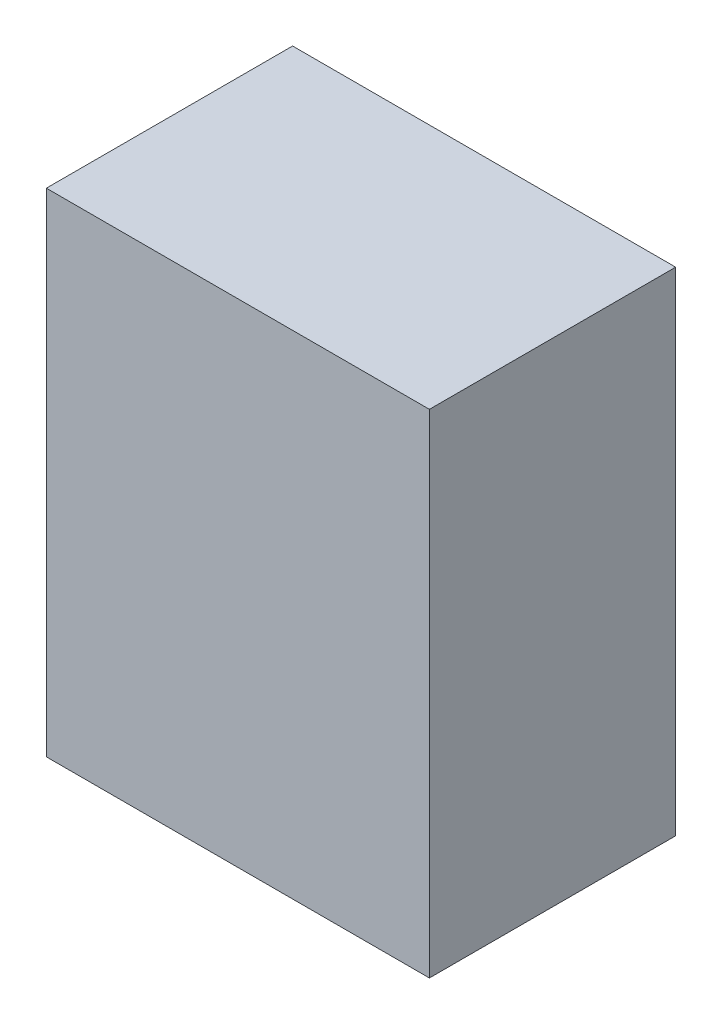
ISO-10303-21;
HEADER;
FILE_DESCRIPTION(('STEP AP214'),'2;1');
FILE_NAME('part.step','',(''),(''),'','','');
FILE_SCHEMA(('AUTOMOTIVE_DESIGN { 1 0 10303 214 1 1 1 1 }'));
ENDSEC;
DATA;
#1=APPLICATION_CONTEXT('core data for automotive mechanical design processes');
#2=APPLICATION_PROTOCOL_DEFINITION('international standard','automotive_design',2000,#1);
#3=PRODUCT_CONTEXT('',#1,'mechanical');
#4=PRODUCT('Part','Part','',(#3));
#5=PRODUCT_RELATED_PRODUCT_CATEGORY('part','',(#4));
#6=PRODUCT_DEFINITION_FORMATION('','',#4);
#7=PRODUCT_DEFINITION_CONTEXT('part definition',#1,'design');
#8=PRODUCT_DEFINITION('design','',#6,#7);
#9=PRODUCT_DEFINITION_SHAPE('','',#8);
#10=(LENGTH_UNIT() NAMED_UNIT(*) SI_UNIT(.MILLI.,.METRE.));
#11=(NAMED_UNIT(*) PLANE_ANGLE_UNIT() SI_UNIT($,.RADIAN.));
#12=(NAMED_UNIT(*) SI_UNIT($,.STERADIAN.) SOLID_ANGLE_UNIT());
#13=UNCERTAINTY_MEASURE_WITH_UNIT(LENGTH_MEASURE(1.E-05),#10,'distance_accuracy_value','');
#14=(GEOMETRIC_REPRESENTATION_CONTEXT(3) GLOBAL_UNCERTAINTY_ASSIGNED_CONTEXT((#13)) GLOBAL_UNIT_ASSIGNED_CONTEXT((#10,
#11,#12)) REPRESENTATION_CONTEXT('',''));
#15=CARTESIAN_POINT('',(0.,0.,0.));
#16=DIRECTION('',(0.,0.,1.));
#17=DIRECTION('',(1.,0.,0.));
#18=AXIS2_PLACEMENT_3D('',#15,#16,#17);
#19=CARTESIAN_POINT('',(1.39999974,-1.79999894,1.79999894));
#20=DIRECTION('',(0.,0.,1.));
#21=DIRECTION('',(1.,0.,0.));
#22=AXIS2_PLACEMENT_3D('',#19,#20,#21);
#23=PLANE('',#22);
#24=DIRECTION('',(0.,1.,0.));
#25=VECTOR('',#24,1.);
#26=CARTESIAN_POINT('',(-1.39999974,-1.79999894,1.79999894));
#27=LINE('',#26,#25);
#28=CARTESIAN_POINT('',(-1.39999974,-1.79999894,1.79999894));
#29=VERTEX_POINT('',#28);
#30=CARTESIAN_POINT('',(-1.39999974,1.80000148,1.79999894));
#31=VERTEX_POINT('',#30);
#32=EDGE_CURVE('E53',#29,#31,#27,.T.);
#33=ORIENTED_EDGE('',*,*,#32,.F.);
#34=DIRECTION('',(1.,0.,0.));
#35=VECTOR('',#34,1.);
#36=CARTESIAN_POINT('',(1.39999974,-1.79999894,1.79999894));
#37=LINE('',#36,#35);
#38=CARTESIAN_POINT('',(1.39999974,-1.79999894,1.79999894));
#39=VERTEX_POINT('',#38);
#40=EDGE_CURVE('E68',#39,#29,#37,.F.);
#41=ORIENTED_EDGE('',*,*,#40,.F.);
#42=DIRECTION('',(0.,1.,0.));
#43=VECTOR('',#42,1.);
#44=CARTESIAN_POINT('',(1.39999974,1.80000148,1.79999894));
#45=LINE('',#44,#43);
#46=CARTESIAN_POINT('',(1.39999974,1.80000148,1.79999894));
#47=VERTEX_POINT('',#46);
#48=EDGE_CURVE('E20',#47,#39,#45,.F.);
#49=ORIENTED_EDGE('',*,*,#48,.F.);
#50=DIRECTION('',(1.,0.,0.));
#51=VECTOR('',#50,1.);
#52=CARTESIAN_POINT('',(-1.39999974,1.80000148,1.79999894));
#53=LINE('',#52,#51);
#54=EDGE_CURVE('E58',#31,#47,#53,.T.);
#55=ORIENTED_EDGE('',*,*,#54,.F.);
#56=EDGE_LOOP('',(#33,#41,#49,#55));
#57=FACE_BOUND('',#56,.T.);
#58=ADVANCED_FACE('F17',(#57),#23,.T.);
#59=CARTESIAN_POINT('',(1.39999974,1.80000148,0.));
#60=DIRECTION('',(1.,0.,0.));
#61=DIRECTION('',(0.,0.,-1.));
#62=AXIS2_PLACEMENT_3D('',#59,#60,#61);
#63=PLANE('',#62);
#64=DIRECTION('',(0.,0.,-1.));
#65=VECTOR('',#64,1.);
#66=CARTESIAN_POINT('',(1.39999974,-1.79999894,0.));
#67=LINE('',#66,#65);
#68=CARTESIAN_POINT('',(1.39999974,-1.79999894,0.));
#69=VERTEX_POINT('',#68);
#70=EDGE_CURVE('E79',#69,#39,#67,.F.);
#71=ORIENTED_EDGE('',*,*,#70,.F.);
#72=DIRECTION('',(0.,1.,0.));
#73=VECTOR('',#72,1.);
#74=CARTESIAN_POINT('',(1.39999974,-1.79999894,0.));
#75=LINE('',#74,#73);
#76=CARTESIAN_POINT('',(1.39999974,1.80000148,0.));
#77=VERTEX_POINT('',#76);
#78=EDGE_CURVE('E74',#69,#77,#75,.T.);
#79=ORIENTED_EDGE('',*,*,#78,.T.);
#80=DIRECTION('',(0.,0.,1.));
#81=VECTOR('',#80,1.);
#82=CARTESIAN_POINT('',(1.39999974,1.80000148,0.));
#83=LINE('',#82,#81);
#84=EDGE_CURVE('E63',#47,#77,#83,.F.);
#85=ORIENTED_EDGE('',*,*,#84,.F.);
#86=ORIENTED_EDGE('',*,*,#48,.T.);
#87=EDGE_LOOP('',(#71,#79,#85,#86));
#88=FACE_BOUND('',#87,.T.);
#89=ADVANCED_FACE('F73',(#88),#63,.T.);
#90=CARTESIAN_POINT('',(-1.39999974,1.80000148,0.));
#91=DIRECTION('',(0.,1.,0.));
#92=DIRECTION('',(0.,0.,1.));
#93=AXIS2_PLACEMENT_3D('',#90,#91,#92);
#94=PLANE('',#93);
#95=ORIENTED_EDGE('',*,*,#84,.T.);
#96=DIRECTION('',(1.,0.,0.));
#97=VECTOR('',#96,1.);
#98=CARTESIAN_POINT('',(1.39999974,1.80000148,0.));
#99=LINE('',#98,#97);
#100=CARTESIAN_POINT('',(-1.39999974,1.80000148,0.));
#101=VERTEX_POINT('',#100);
#102=EDGE_CURVE('E84',#77,#101,#99,.F.);
#103=ORIENTED_EDGE('',*,*,#102,.T.);
#104=DIRECTION('',(0.,0.,1.));
#105=VECTOR('',#104,1.);
#106=CARTESIAN_POINT('',(-1.39999974,1.80000148,0.));
#107=LINE('',#106,#105);
#108=EDGE_CURVE('E65',#31,#101,#107,.F.);
#109=ORIENTED_EDGE('',*,*,#108,.F.);
#110=ORIENTED_EDGE('',*,*,#54,.T.);
#111=EDGE_LOOP('',(#95,#103,#109,#110));
#112=FACE_BOUND('',#111,.T.);
#113=ADVANCED_FACE('F60',(#112),#94,.T.);
#114=CARTESIAN_POINT('',(-1.39999974,-1.79999894,0.));
#115=DIRECTION('',(-1.,0.,0.));
#116=DIRECTION('',(0.,0.,1.));
#117=AXIS2_PLACEMENT_3D('',#114,#115,#116);
#118=PLANE('',#117);
#119=ORIENTED_EDGE('',*,*,#108,.T.);
#120=DIRECTION('',(0.,1.,0.));
#121=VECTOR('',#120,1.);
#122=CARTESIAN_POINT('',(-1.39999974,-1.79999894,0.));
#123=LINE('',#122,#121);
#124=CARTESIAN_POINT('',(-1.39999974,-1.79999894,0.));
#125=VERTEX_POINT('',#124);
#126=EDGE_CURVE('E26',#101,#125,#123,.F.);
#127=ORIENTED_EDGE('',*,*,#126,.T.);
#128=DIRECTION('',(0.,0.,-1.));
#129=VECTOR('',#128,1.);
#130=CARTESIAN_POINT('',(-1.39999974,-1.79999894,0.));
#131=LINE('',#130,#129);
#132=EDGE_CURVE('E34',#29,#125,#131,.T.);
#133=ORIENTED_EDGE('',*,*,#132,.F.);
#134=ORIENTED_EDGE('',*,*,#32,.T.);
#135=EDGE_LOOP('',(#119,#127,#133,#134));
#136=FACE_BOUND('',#135,.T.);
#137=ADVANCED_FACE('F88',(#136),#118,.T.);
#138=CARTESIAN_POINT('',(1.39999974,-1.79999894,0.));
#139=DIRECTION('',(0.,-1.,0.));
#140=DIRECTION('',(0.,0.,-1.));
#141=AXIS2_PLACEMENT_3D('',#138,#139,#140);
#142=PLANE('',#141);
#143=ORIENTED_EDGE('',*,*,#132,.T.);
#144=DIRECTION('',(1.,0.,0.));
#145=VECTOR('',#144,1.);
#146=CARTESIAN_POINT('',(1.39999974,-1.79999894,0.));
#147=LINE('',#146,#145);
#148=EDGE_CURVE('E11',#125,#69,#147,.T.);
#149=ORIENTED_EDGE('',*,*,#148,.T.);
#150=ORIENTED_EDGE('',*,*,#70,.T.);
#151=ORIENTED_EDGE('',*,*,#40,.T.);
#152=EDGE_LOOP('',(#143,#149,#150,#151));
#153=FACE_BOUND('',#152,.T.);
#154=ADVANCED_FACE('F91',(#153),#142,.T.);
#155=CARTESIAN_POINT('',(1.39999974,-1.79999894,0.));
#156=DIRECTION('',(0.,0.,1.));
#157=DIRECTION('',(1.,0.,0.));
#158=AXIS2_PLACEMENT_3D('',#155,#156,#157);
#159=PLANE('',#158);
#160=ORIENTED_EDGE('',*,*,#126,.F.);
#161=ORIENTED_EDGE('',*,*,#102,.F.);
#162=ORIENTED_EDGE('',*,*,#78,.F.);
#163=ORIENTED_EDGE('',*,*,#148,.F.);
#164=EDGE_LOOP('',(#160,#161,#162,#163));
#165=FACE_BOUND('',#164,.T.);
#166=ADVANCED_FACE('F90',(#165),#159,.F.);
#167=CLOSED_SHELL('',(#58,#89,#113,#137,#154,#166));
#168=MANIFOLD_SOLID_BREP('B1',#167);
#169=ADVANCED_BREP_SHAPE_REPRESENTATION('',(#18,#168),#14);
#170=SHAPE_DEFINITION_REPRESENTATION(#9,#169);
ENDSEC;
END-ISO-10303-21;
